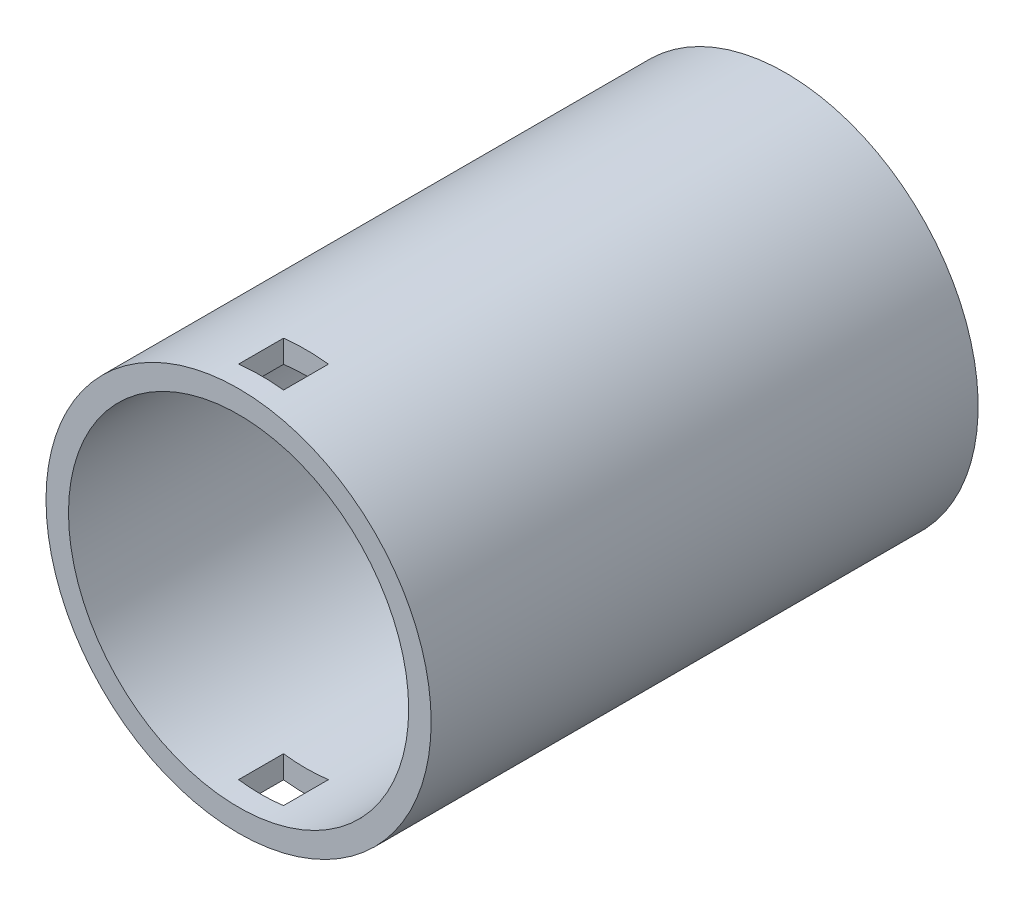
ISO-10303-21;
HEADER;
FILE_DESCRIPTION(('STEP AP214'),'2;1');
FILE_NAME('part.step','',(''),(''),'','','');
FILE_SCHEMA(('AUTOMOTIVE_DESIGN { 1 0 10303 214 1 1 1 1 }'));
ENDSEC;
DATA;
#1=APPLICATION_CONTEXT('core data for automotive mechanical design processes');
#2=APPLICATION_PROTOCOL_DEFINITION('international standard','automotive_design',2000,#1);
#3=PRODUCT_CONTEXT('',#1,'mechanical');
#4=PRODUCT('Part','Part','',(#3));
#5=PRODUCT_RELATED_PRODUCT_CATEGORY('part','',(#4));
#6=PRODUCT_DEFINITION_FORMATION('','',#4);
#7=PRODUCT_DEFINITION_CONTEXT('part definition',#1,'design');
#8=PRODUCT_DEFINITION('design','',#6,#7);
#9=PRODUCT_DEFINITION_SHAPE('','',#8);
#10=(LENGTH_UNIT() NAMED_UNIT(*) SI_UNIT(.MILLI.,.METRE.));
#11=(NAMED_UNIT(*) PLANE_ANGLE_UNIT() SI_UNIT($,.RADIAN.));
#12=(NAMED_UNIT(*) SI_UNIT($,.STERADIAN.) SOLID_ANGLE_UNIT());
#13=UNCERTAINTY_MEASURE_WITH_UNIT(LENGTH_MEASURE(1.E-05),#10,'distance_accuracy_value','');
#14=(GEOMETRIC_REPRESENTATION_CONTEXT(3) GLOBAL_UNCERTAINTY_ASSIGNED_CONTEXT((#13)) GLOBAL_UNIT_ASSIGNED_CONTEXT((#10,
#11,#12)) REPRESENTATION_CONTEXT('',''));
#15=CARTESIAN_POINT('',(0.,0.,0.));
#16=DIRECTION('',(0.,0.,1.));
#17=DIRECTION('',(1.,0.,0.));
#18=AXIS2_PLACEMENT_3D('',#15,#16,#17);
#19=CARTESIAN_POINT('',(0.,0.,35.));
#20=DIRECTION('',(0.,0.,1.));
#21=DIRECTION('',(1.,0.,0.));
#22=AXIS2_PLACEMENT_3D('',#19,#20,#21);
#23=PLANE('',#22);
#24=CARTESIAN_POINT('',(0.,0.,35.));
#25=DIRECTION('',(0.,0.,1.));
#26=DIRECTION('',(1.,0.,0.));
#27=AXIS2_PLACEMENT_3D('',#24,#25,#26);
#28=CIRCLE('',#27,12.85);
#29=CARTESIAN_POINT('',(12.85,0.,35.));
#30=VERTEX_POINT('',#29);
#31=EDGE_CURVE('E110',#30,#30,#28,.T.);
#32=ORIENTED_EDGE('',*,*,#31,.T.);
#33=EDGE_LOOP('',(#32));
#34=FACE_BOUND('',#33,.T.);
#35=CARTESIAN_POINT('',(0.,0.,35.));
#36=DIRECTION('',(0.,0.,1.));
#37=DIRECTION('',(1.,0.,0.));
#38=AXIS2_PLACEMENT_3D('',#35,#36,#37);
#39=CIRCLE('',#38,11.35);
#40=CARTESIAN_POINT('',(11.35,0.,35.));
#41=VERTEX_POINT('',#40);
#42=EDGE_CURVE('E175',#41,#41,#39,.T.);
#43=ORIENTED_EDGE('',*,*,#42,.F.);
#44=EDGE_LOOP('',(#43));
#45=FACE_BOUND('',#44,.T.);
#46=ADVANCED_FACE('F33',(#34,#45),#23,.T.);
#47=CARTESIAN_POINT('',(0.,0.,35.));
#48=DIRECTION('',(0.,0.,-1.));
#49=DIRECTION('',(-1.,0.,0.));
#50=AXIS2_PLACEMENT_3D('',#47,#48,#49);
#51=CYLINDRICAL_SURFACE('',#50,12.85);
#52=DIRECTION('',(0.,0.,-1.));
#53=VECTOR('',#52,1.);
#54=CARTESIAN_POINT('',(1.5,-12.7621510726053,35.));
#55=LINE('',#54,#53);
#56=CARTESIAN_POINT('',(1.5,-12.7621510726053,33.5));
#57=VERTEX_POINT('',#56);
#58=CARTESIAN_POINT('',(1.5,-12.7621510726053,30.5));
#59=VERTEX_POINT('',#58);
#60=EDGE_CURVE('E169',#57,#59,#55,.T.);
#61=ORIENTED_EDGE('',*,*,#60,.T.);
#62=CARTESIAN_POINT('',(0.,0.,30.5));
#63=DIRECTION('',(0.,0.,-1.));
#64=DIRECTION('',(-1.,0.,0.));
#65=AXIS2_PLACEMENT_3D('',#62,#63,#64);
#66=CIRCLE('',#65,12.85);
#67=CARTESIAN_POINT('',(-1.5,-12.7621510726053,30.5));
#68=VERTEX_POINT('',#67);
#69=EDGE_CURVE('E48',#59,#68,#66,.T.);
#70=ORIENTED_EDGE('',*,*,#69,.T.);
#71=DIRECTION('',(0.,0.,-1.));
#72=VECTOR('',#71,1.);
#73=CARTESIAN_POINT('',(-1.5,-12.7621510726053,35.));
#74=LINE('',#73,#72);
#75=CARTESIAN_POINT('',(-1.5,-12.7621510726053,33.5));
#76=VERTEX_POINT('',#75);
#77=EDGE_CURVE('E117',#68,#76,#74,.F.);
#78=ORIENTED_EDGE('',*,*,#77,.T.);
#79=CARTESIAN_POINT('',(0.,0.,33.5));
#80=DIRECTION('',(0.,0.,1.));
#81=DIRECTION('',(1.,0.,0.));
#82=AXIS2_PLACEMENT_3D('',#79,#80,#81);
#83=CIRCLE('',#82,12.85);
#84=EDGE_CURVE('E165',#76,#57,#83,.T.);
#85=ORIENTED_EDGE('',*,*,#84,.T.);
#86=EDGE_LOOP('',(#61,#70,#78,#85));
#87=FACE_BOUND('',#86,.T.);
#88=DIRECTION('',(0.,0.,-1.));
#89=VECTOR('',#88,1.);
#90=CARTESIAN_POINT('',(-1.5,12.7621510726053,35.));
#91=LINE('',#90,#89);
#92=CARTESIAN_POINT('',(-1.5,12.7621510726053,33.5));
#93=VERTEX_POINT('',#92);
#94=CARTESIAN_POINT('',(-1.5,12.7621510726053,30.5));
#95=VERTEX_POINT('',#94);
#96=EDGE_CURVE('E157',#93,#95,#91,.T.);
#97=ORIENTED_EDGE('',*,*,#96,.T.);
#98=CARTESIAN_POINT('',(1.5,12.7621510726053,30.5));
#99=VERTEX_POINT('',#98);
#100=EDGE_CURVE('E56',#95,#99,#66,.T.);
#101=ORIENTED_EDGE('',*,*,#100,.T.);
#102=DIRECTION('',(0.,0.,-1.));
#103=VECTOR('',#102,1.);
#104=CARTESIAN_POINT('',(1.5,12.7621510726053,35.));
#105=LINE('',#104,#103);
#106=CARTESIAN_POINT('',(1.5,12.7621510726053,33.5));
#107=VERTEX_POINT('',#106);
#108=EDGE_CURVE('E148',#99,#107,#105,.F.);
#109=ORIENTED_EDGE('',*,*,#108,.T.);
#110=EDGE_CURVE('E166',#107,#93,#83,.T.);
#111=ORIENTED_EDGE('',*,*,#110,.T.);
#112=EDGE_LOOP('',(#97,#101,#109,#111));
#113=FACE_BOUND('',#112,.T.);
#114=ORIENTED_EDGE('',*,*,#31,.F.);
#115=EDGE_LOOP('',(#114));
#116=FACE_BOUND('',#115,.T.);
#117=CARTESIAN_POINT('',(0.,0.,-1.5));
#118=DIRECTION('',(0.,0.,-1.));
#119=DIRECTION('',(-1.,0.,0.));
#120=AXIS2_PLACEMENT_3D('',#117,#118,#119);
#121=CIRCLE('',#120,12.85);
#122=CARTESIAN_POINT('',(-12.85,0.,-1.5));
#123=VERTEX_POINT('',#122);
#124=EDGE_CURVE('E171',#123,#123,#121,.T.);
#125=ORIENTED_EDGE('',*,*,#124,.F.);
#126=EDGE_LOOP('',(#125));
#127=FACE_BOUND('',#126,.T.);
#128=ADVANCED_FACE('F35',(#87,#113,#116,#127),#51,.T.);
#129=CARTESIAN_POINT('',(0.,0.,35.));
#130=DIRECTION('',(0.,0.,-1.));
#131=DIRECTION('',(-1.,0.,0.));
#132=AXIS2_PLACEMENT_3D('',#129,#130,#131);
#133=CYLINDRICAL_SURFACE('',#132,11.35);
#134=DIRECTION('',(0.,0.,-1.));
#135=VECTOR('',#134,1.);
#136=CARTESIAN_POINT('',(1.5,11.2504444356656,35.));
#137=LINE('',#136,#135);
#138=CARTESIAN_POINT('',(1.5,11.2504444356656,30.5));
#139=VERTEX_POINT('',#138);
#140=CARTESIAN_POINT('',(1.5,11.2504444356656,33.5));
#141=VERTEX_POINT('',#140);
#142=EDGE_CURVE('E11',#139,#141,#137,.F.);
#143=ORIENTED_EDGE('',*,*,#142,.F.);
#144=CARTESIAN_POINT('',(0.,0.,30.5));
#145=DIRECTION('',(0.,0.,-1.));
#146=DIRECTION('',(-1.,0.,0.));
#147=AXIS2_PLACEMENT_3D('',#144,#145,#146);
#148=CIRCLE('',#147,11.35);
#149=CARTESIAN_POINT('',(-1.5,11.2504444356656,30.5));
#150=VERTEX_POINT('',#149);
#151=EDGE_CURVE('E112',#150,#139,#148,.T.);
#152=ORIENTED_EDGE('',*,*,#151,.F.);
#153=DIRECTION('',(0.,0.,-1.));
#154=VECTOR('',#153,1.);
#155=CARTESIAN_POINT('',(-1.5,11.2504444356656,35.));
#156=LINE('',#155,#154);
#157=CARTESIAN_POINT('',(-1.5,11.2504444356656,33.5));
#158=VERTEX_POINT('',#157);
#159=EDGE_CURVE('E130',#158,#150,#156,.T.);
#160=ORIENTED_EDGE('',*,*,#159,.F.);
#161=CARTESIAN_POINT('',(0.,0.,33.5));
#162=DIRECTION('',(0.,0.,1.));
#163=DIRECTION('',(1.,0.,0.));
#164=AXIS2_PLACEMENT_3D('',#161,#162,#163);
#165=CIRCLE('',#164,11.35);
#166=EDGE_CURVE('E41',#141,#158,#165,.T.);
#167=ORIENTED_EDGE('',*,*,#166,.F.);
#168=EDGE_LOOP('',(#143,#152,#160,#167));
#169=FACE_BOUND('',#168,.T.);
#170=DIRECTION('',(0.,0.,-1.));
#171=VECTOR('',#170,1.);
#172=CARTESIAN_POINT('',(1.5,-11.2504444356656,35.));
#173=LINE('',#172,#171);
#174=CARTESIAN_POINT('',(1.5,-11.2504444356656,33.5));
#175=VERTEX_POINT('',#174);
#176=CARTESIAN_POINT('',(1.5,-11.2504444356656,30.5));
#177=VERTEX_POINT('',#176);
#178=EDGE_CURVE('E126',#175,#177,#173,.T.);
#179=ORIENTED_EDGE('',*,*,#178,.F.);
#180=CARTESIAN_POINT('',(-1.5,-11.2504444356656,33.5));
#181=VERTEX_POINT('',#180);
#182=EDGE_CURVE('E124',#181,#175,#165,.T.);
#183=ORIENTED_EDGE('',*,*,#182,.F.);
#184=DIRECTION('',(0.,0.,-1.));
#185=VECTOR('',#184,1.);
#186=CARTESIAN_POINT('',(-1.5,-11.2504444356656,35.));
#187=LINE('',#186,#185);
#188=CARTESIAN_POINT('',(-1.5,-11.2504444356656,30.5));
#189=VERTEX_POINT('',#188);
#190=EDGE_CURVE('E109',#189,#181,#187,.F.);
#191=ORIENTED_EDGE('',*,*,#190,.F.);
#192=EDGE_CURVE('E98',#177,#189,#148,.T.);
#193=ORIENTED_EDGE('',*,*,#192,.F.);
#194=EDGE_LOOP('',(#179,#183,#191,#193));
#195=FACE_BOUND('',#194,.T.);
#196=ORIENTED_EDGE('',*,*,#42,.T.);
#197=EDGE_LOOP('',(#196));
#198=FACE_BOUND('',#197,.T.);
#199=CARTESIAN_POINT('',(0.,0.,0.));
#200=DIRECTION('',(0.,0.,1.));
#201=DIRECTION('',(1.,0.,0.));
#202=AXIS2_PLACEMENT_3D('',#199,#200,#201);
#203=CIRCLE('',#202,11.35);
#204=CARTESIAN_POINT('',(11.35,0.,0.));
#205=VERTEX_POINT('',#204);
#206=EDGE_CURVE('E174',#205,#205,#203,.T.);
#207=ORIENTED_EDGE('',*,*,#206,.F.);
#208=EDGE_LOOP('',(#207));
#209=FACE_BOUND('',#208,.T.);
#210=ADVANCED_FACE('F122',(#169,#195,#198,#209),#133,.F.);
#211=CARTESIAN_POINT('',(0.,0.,0.));
#212=DIRECTION('',(0.,0.,-1.));
#213=DIRECTION('',(-1.,0.,0.));
#214=AXIS2_PLACEMENT_3D('',#211,#212,#213);
#215=PLANE('',#214);
#216=ORIENTED_EDGE('',*,*,#206,.T.);
#217=EDGE_LOOP('',(#216));
#218=FACE_BOUND('',#217,.T.);
#219=ADVANCED_FACE('F190',(#218),#215,.F.);
#220=CARTESIAN_POINT('',(0.,0.,-1.5));
#221=DIRECTION('',(0.,0.,-1.));
#222=DIRECTION('',(-1.,0.,0.));
#223=AXIS2_PLACEMENT_3D('',#220,#221,#222);
#224=PLANE('',#223);
#225=ORIENTED_EDGE('',*,*,#124,.T.);
#226=EDGE_LOOP('',(#225));
#227=FACE_BOUND('',#226,.T.);
#228=ADVANCED_FACE('F188',(#227),#224,.T.);
#229=CARTESIAN_POINT('',(-1.5,-12.85,30.5));
#230=DIRECTION('',(0.,0.,-1.));
#231=DIRECTION('',(-1.,0.,0.));
#232=AXIS2_PLACEMENT_3D('',#229,#230,#231);
#233=PLANE('',#232);
#234=DIRECTION('',(0.,1.,0.));
#235=VECTOR('',#234,1.);
#236=CARTESIAN_POINT('',(1.5,-12.85,30.5));
#237=LINE('',#236,#235);
#238=EDGE_CURVE('E104',#59,#177,#237,.T.);
#239=ORIENTED_EDGE('',*,*,#238,.T.);
#240=ORIENTED_EDGE('',*,*,#192,.T.);
#241=DIRECTION('',(0.,1.,0.));
#242=VECTOR('',#241,1.);
#243=CARTESIAN_POINT('',(-1.5,-12.85,30.5));
#244=LINE('',#243,#242);
#245=EDGE_CURVE('E101',#68,#189,#244,.T.);
#246=ORIENTED_EDGE('',*,*,#245,.F.);
#247=ORIENTED_EDGE('',*,*,#69,.F.);
#248=EDGE_LOOP('',(#239,#240,#246,#247));
#249=FACE_BOUND('',#248,.T.);
#250=ADVANCED_FACE('F100',(#249),#233,.F.);
#251=CARTESIAN_POINT('',(-1.5,-12.85,30.5));
#252=DIRECTION('',(-1.,0.,0.));
#253=DIRECTION('',(0.,0.,1.));
#254=AXIS2_PLACEMENT_3D('',#251,#252,#253);
#255=PLANE('',#254);
#256=ORIENTED_EDGE('',*,*,#245,.T.);
#257=ORIENTED_EDGE('',*,*,#190,.T.);
#258=DIRECTION('',(0.,1.,0.));
#259=VECTOR('',#258,1.);
#260=CARTESIAN_POINT('',(-1.5,-12.85,33.5));
#261=LINE('',#260,#259);
#262=EDGE_CURVE('E158',#76,#181,#261,.T.);
#263=ORIENTED_EDGE('',*,*,#262,.F.);
#264=ORIENTED_EDGE('',*,*,#77,.F.);
#265=EDGE_LOOP('',(#256,#257,#263,#264));
#266=FACE_BOUND('',#265,.T.);
#267=ADVANCED_FACE('F114',(#266),#255,.F.);
#268=CARTESIAN_POINT('',(-1.5,-12.85,33.5));
#269=DIRECTION('',(0.,0.,1.));
#270=DIRECTION('',(1.,0.,0.));
#271=AXIS2_PLACEMENT_3D('',#268,#269,#270);
#272=PLANE('',#271);
#273=ORIENTED_EDGE('',*,*,#262,.T.);
#274=ORIENTED_EDGE('',*,*,#182,.T.);
#275=DIRECTION('',(0.,1.,0.));
#276=VECTOR('',#275,1.);
#277=CARTESIAN_POINT('',(1.5,-12.85,33.5));
#278=LINE('',#277,#276);
#279=EDGE_CURVE('E298',#57,#175,#278,.T.);
#280=ORIENTED_EDGE('',*,*,#279,.F.);
#281=ORIENTED_EDGE('',*,*,#84,.F.);
#282=EDGE_LOOP('',(#273,#274,#280,#281));
#283=FACE_BOUND('',#282,.T.);
#284=ADVANCED_FACE('F245',(#283),#272,.F.);
#285=CARTESIAN_POINT('',(1.5,-12.85,30.5));
#286=DIRECTION('',(1.,0.,0.));
#287=DIRECTION('',(0.,0.,-1.));
#288=AXIS2_PLACEMENT_3D('',#285,#286,#287);
#289=PLANE('',#288);
#290=ORIENTED_EDGE('',*,*,#279,.T.);
#291=ORIENTED_EDGE('',*,*,#178,.T.);
#292=ORIENTED_EDGE('',*,*,#238,.F.);
#293=ORIENTED_EDGE('',*,*,#60,.F.);
#294=EDGE_LOOP('',(#290,#291,#292,#293));
#295=FACE_BOUND('',#294,.T.);
#296=ADVANCED_FACE('F253',(#295),#289,.F.);
#297=EDGE_CURVE('E140',#139,#99,#237,.T.);
#298=ORIENTED_EDGE('',*,*,#297,.F.);
#299=ORIENTED_EDGE('',*,*,#142,.T.);
#300=EDGE_CURVE('E154',#141,#107,#278,.T.);
#301=ORIENTED_EDGE('',*,*,#300,.T.);
#302=ORIENTED_EDGE('',*,*,#108,.F.);
#303=EDGE_LOOP('',(#298,#299,#301,#302));
#304=FACE_BOUND('',#303,.T.);
#305=ADVANCED_FACE('F145',(#304),#289,.F.);
#306=ORIENTED_EDGE('',*,*,#300,.F.);
#307=ORIENTED_EDGE('',*,*,#166,.T.);
#308=EDGE_CURVE('E118',#158,#93,#261,.T.);
#309=ORIENTED_EDGE('',*,*,#308,.T.);
#310=ORIENTED_EDGE('',*,*,#110,.F.);
#311=EDGE_LOOP('',(#306,#307,#309,#310));
#312=FACE_BOUND('',#311,.T.);
#313=ADVANCED_FACE('F153',(#312),#272,.F.);
#314=ORIENTED_EDGE('',*,*,#308,.F.);
#315=ORIENTED_EDGE('',*,*,#159,.T.);
#316=EDGE_CURVE('E119',#150,#95,#244,.T.);
#317=ORIENTED_EDGE('',*,*,#316,.T.);
#318=ORIENTED_EDGE('',*,*,#96,.F.);
#319=EDGE_LOOP('',(#314,#315,#317,#318));
#320=FACE_BOUND('',#319,.T.);
#321=ADVANCED_FACE('F156',(#320),#255,.F.);
#322=ORIENTED_EDGE('',*,*,#316,.F.);
#323=ORIENTED_EDGE('',*,*,#151,.T.);
#324=ORIENTED_EDGE('',*,*,#297,.T.);
#325=ORIENTED_EDGE('',*,*,#100,.F.);
#326=EDGE_LOOP('',(#322,#323,#324,#325));
#327=FACE_BOUND('',#326,.T.);
#328=ADVANCED_FACE('F139',(#327),#233,.F.);
#329=CLOSED_SHELL('',(#46,#128,#210,#219,#228,#250,#267,#284,#296,#305,#313,#321,#328));
#330=MANIFOLD_SOLID_BREP('B2',#329);
#331=ADVANCED_BREP_SHAPE_REPRESENTATION('',(#18,#330),#14);
#332=SHAPE_DEFINITION_REPRESENTATION(#9,#331);
ENDSEC;
END-ISO-10303-21;
